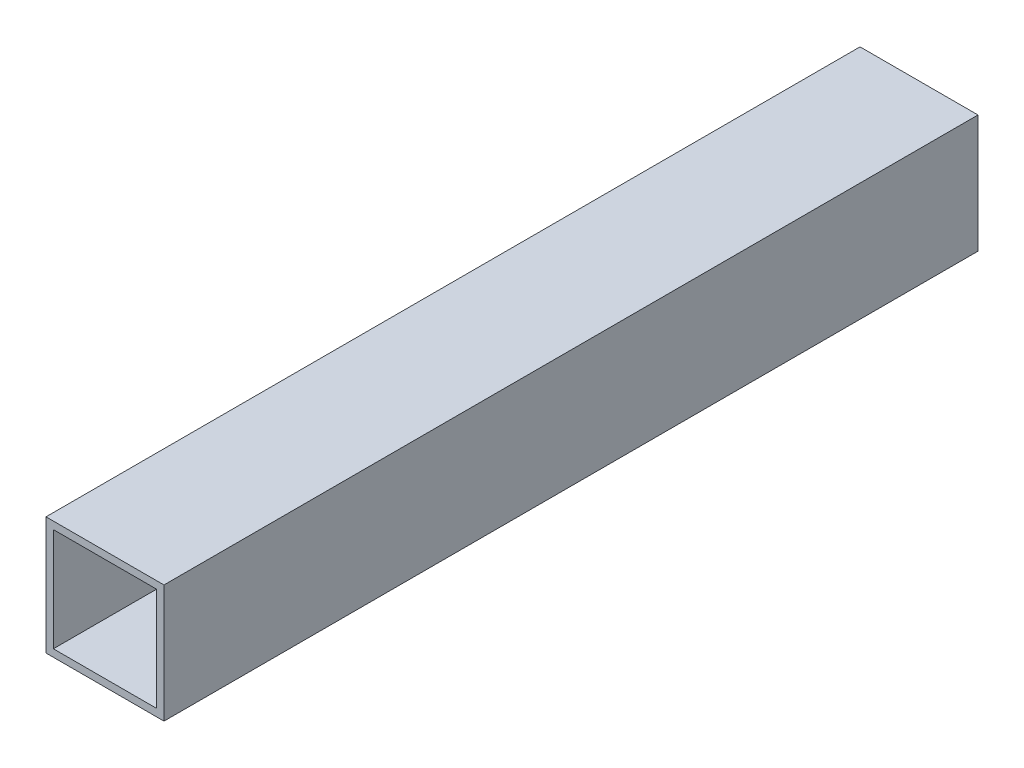
ISO-10303-21;
HEADER;
FILE_DESCRIPTION(('STEP AP214'),'2;1');
FILE_NAME('part.step','',(''),(''),'','','');
FILE_SCHEMA(('AUTOMOTIVE_DESIGN { 1 0 10303 214 1 1 1 1 }'));
ENDSEC;
DATA;
#1=APPLICATION_CONTEXT('core data for automotive mechanical design processes');
#2=APPLICATION_PROTOCOL_DEFINITION('international standard','automotive_design',2000,#1);
#3=PRODUCT_CONTEXT('',#1,'mechanical');
#4=PRODUCT('Part','Part','',(#3));
#5=PRODUCT_RELATED_PRODUCT_CATEGORY('part','',(#4));
#6=PRODUCT_DEFINITION_FORMATION('','',#4);
#7=PRODUCT_DEFINITION_CONTEXT('part definition',#1,'design');
#8=PRODUCT_DEFINITION('design','',#6,#7);
#9=PRODUCT_DEFINITION_SHAPE('','',#8);
#10=(LENGTH_UNIT() NAMED_UNIT(*) SI_UNIT(.MILLI.,.METRE.));
#11=(NAMED_UNIT(*) PLANE_ANGLE_UNIT() SI_UNIT($,.RADIAN.));
#12=(NAMED_UNIT(*) SI_UNIT($,.STERADIAN.) SOLID_ANGLE_UNIT());
#13=UNCERTAINTY_MEASURE_WITH_UNIT(LENGTH_MEASURE(1.E-05),#10,'distance_accuracy_value','');
#14=(GEOMETRIC_REPRESENTATION_CONTEXT(3) GLOBAL_UNCERTAINTY_ASSIGNED_CONTEXT((#13)) GLOBAL_UNIT_ASSIGNED_CONTEXT((#10,
#11,#12)) REPRESENTATION_CONTEXT('',''));
#15=CARTESIAN_POINT('',(0.,0.,0.));
#16=DIRECTION('',(0.,0.,1.));
#17=DIRECTION('',(1.,0.,0.));
#18=AXIS2_PLACEMENT_3D('',#15,#16,#17);
#19=CARTESIAN_POINT('',(12.7,-12.7,87.63));
#20=DIRECTION('',(-1.,0.,0.));
#21=DIRECTION('',(0.,0.,1.));
#22=AXIS2_PLACEMENT_3D('',#19,#20,#21);
#23=PLANE('',#22);
#24=DIRECTION('',(0.,1.,0.));
#25=VECTOR('',#24,1.);
#26=CARTESIAN_POINT('',(12.7,-12.7,-87.63));
#27=LINE('',#26,#25);
#28=CARTESIAN_POINT('',(12.7,-12.7,-87.63));
#29=VERTEX_POINT('',#28);
#30=CARTESIAN_POINT('',(12.7,12.7,-87.63));
#31=VERTEX_POINT('',#30);
#32=EDGE_CURVE('E132',#29,#31,#27,.T.);
#33=ORIENTED_EDGE('',*,*,#32,.T.);
#34=DIRECTION('',(0.,0.,-1.));
#35=VECTOR('',#34,1.);
#36=CARTESIAN_POINT('',(12.7,12.7,87.63));
#37=LINE('',#36,#35);
#38=CARTESIAN_POINT('',(12.7,12.7,87.63));
#39=VERTEX_POINT('',#38);
#40=EDGE_CURVE('E11',#39,#31,#37,.T.);
#41=ORIENTED_EDGE('',*,*,#40,.F.);
#42=DIRECTION('',(0.,1.,0.));
#43=VECTOR('',#42,1.);
#44=CARTESIAN_POINT('',(12.7,-12.7,87.63));
#45=LINE('',#44,#43);
#46=CARTESIAN_POINT('',(12.7,-12.7,87.63));
#47=VERTEX_POINT('',#46);
#48=EDGE_CURVE('E136',#47,#39,#45,.T.);
#49=ORIENTED_EDGE('',*,*,#48,.F.);
#50=DIRECTION('',(0.,0.,-1.));
#51=VECTOR('',#50,1.);
#52=CARTESIAN_POINT('',(12.7,-12.7,87.63));
#53=LINE('',#52,#51);
#54=EDGE_CURVE('E146',#47,#29,#53,.T.);
#55=ORIENTED_EDGE('',*,*,#54,.T.);
#56=EDGE_LOOP('',(#33,#41,#49,#55));
#57=FACE_BOUND('',#56,.T.);
#58=ADVANCED_FACE('F35',(#57),#23,.F.);
#59=CARTESIAN_POINT('',(-12.7,12.7,87.63));
#60=DIRECTION('',(0.,-1.,0.));
#61=DIRECTION('',(0.,0.,-1.));
#62=AXIS2_PLACEMENT_3D('',#59,#60,#61);
#63=PLANE('',#62);
#64=DIRECTION('',(-1.,0.,0.));
#65=VECTOR('',#64,1.);
#66=CARTESIAN_POINT('',(-12.7,12.7,-87.63));
#67=LINE('',#66,#65);
#68=CARTESIAN_POINT('',(-12.7,12.7,-87.63));
#69=VERTEX_POINT('',#68);
#70=EDGE_CURVE('E149',#31,#69,#67,.T.);
#71=ORIENTED_EDGE('',*,*,#70,.T.);
#72=DIRECTION('',(0.,0.,-1.));
#73=VECTOR('',#72,1.);
#74=CARTESIAN_POINT('',(-12.7,12.7,87.63));
#75=LINE('',#74,#73);
#76=CARTESIAN_POINT('',(-12.7,12.7,87.63));
#77=VERTEX_POINT('',#76);
#78=EDGE_CURVE('E42',#77,#69,#75,.T.);
#79=ORIENTED_EDGE('',*,*,#78,.F.);
#80=DIRECTION('',(-1.,0.,0.));
#81=VECTOR('',#80,1.);
#82=CARTESIAN_POINT('',(-12.7,12.7,87.63));
#83=LINE('',#82,#81);
#84=EDGE_CURVE('E139',#39,#77,#83,.T.);
#85=ORIENTED_EDGE('',*,*,#84,.F.);
#86=ORIENTED_EDGE('',*,*,#40,.T.);
#87=EDGE_LOOP('',(#71,#79,#85,#86));
#88=FACE_BOUND('',#87,.T.);
#89=ADVANCED_FACE('F177',(#88),#63,.F.);
#90=CARTESIAN_POINT('',(-12.7,-12.7,87.63));
#91=DIRECTION('',(1.,0.,0.));
#92=DIRECTION('',(0.,0.,-1.));
#93=AXIS2_PLACEMENT_3D('',#90,#91,#92);
#94=PLANE('',#93);
#95=DIRECTION('',(0.,-1.,0.));
#96=VECTOR('',#95,1.);
#97=CARTESIAN_POINT('',(-12.7,-12.7,-87.63));
#98=LINE('',#97,#96);
#99=CARTESIAN_POINT('',(-12.7,-12.7,-87.63));
#100=VERTEX_POINT('',#99);
#101=EDGE_CURVE('E151',#69,#100,#98,.T.);
#102=ORIENTED_EDGE('',*,*,#101,.T.);
#103=DIRECTION('',(0.,0.,-1.));
#104=VECTOR('',#103,1.);
#105=CARTESIAN_POINT('',(-12.7,-12.7,87.63));
#106=LINE('',#105,#104);
#107=CARTESIAN_POINT('',(-12.7,-12.7,87.63));
#108=VERTEX_POINT('',#107);
#109=EDGE_CURVE('E156',#108,#100,#106,.T.);
#110=ORIENTED_EDGE('',*,*,#109,.F.);
#111=DIRECTION('',(0.,-1.,0.));
#112=VECTOR('',#111,1.);
#113=CARTESIAN_POINT('',(-12.7,-12.7,87.63));
#114=LINE('',#113,#112);
#115=EDGE_CURVE('E142',#77,#108,#114,.T.);
#116=ORIENTED_EDGE('',*,*,#115,.F.);
#117=ORIENTED_EDGE('',*,*,#78,.T.);
#118=EDGE_LOOP('',(#102,#110,#116,#117));
#119=FACE_BOUND('',#118,.T.);
#120=ADVANCED_FACE('F163',(#119),#94,.F.);
#121=CARTESIAN_POINT('',(-12.7,-12.7,87.63));
#122=DIRECTION('',(0.,1.,0.));
#123=DIRECTION('',(0.,0.,1.));
#124=AXIS2_PLACEMENT_3D('',#121,#122,#123);
#125=PLANE('',#124);
#126=DIRECTION('',(1.,0.,0.));
#127=VECTOR('',#126,1.);
#128=CARTESIAN_POINT('',(-12.7,-12.7,-87.63));
#129=LINE('',#128,#127);
#130=EDGE_CURVE('E140',#100,#29,#129,.T.);
#131=ORIENTED_EDGE('',*,*,#130,.T.);
#132=ORIENTED_EDGE('',*,*,#54,.F.);
#133=DIRECTION('',(1.,0.,0.));
#134=VECTOR('',#133,1.);
#135=CARTESIAN_POINT('',(-12.7,-12.7,87.63));
#136=LINE('',#135,#134);
#137=EDGE_CURVE('E144',#108,#47,#136,.T.);
#138=ORIENTED_EDGE('',*,*,#137,.F.);
#139=ORIENTED_EDGE('',*,*,#109,.T.);
#140=EDGE_LOOP('',(#131,#132,#138,#139));
#141=FACE_BOUND('',#140,.T.);
#142=ADVANCED_FACE('F170',(#141),#125,.F.);
#143=CARTESIAN_POINT('',(0.,0.,87.63));
#144=DIRECTION('',(0.,0.,-1.));
#145=DIRECTION('',(-1.,0.,0.));
#146=AXIS2_PLACEMENT_3D('',#143,#144,#145);
#147=PLANE('',#146);
#148=DIRECTION('',(-1.,0.,0.));
#149=VECTOR('',#148,1.);
#150=CARTESIAN_POINT('',(-11.1125,11.1125,87.63));
#151=LINE('',#150,#149);
#152=CARTESIAN_POINT('',(11.1125,11.1125,87.63));
#153=VERTEX_POINT('',#152);
#154=CARTESIAN_POINT('',(-11.1125,11.1125,87.63));
#155=VERTEX_POINT('',#154);
#156=EDGE_CURVE('E126',#153,#155,#151,.T.);
#157=ORIENTED_EDGE('',*,*,#156,.F.);
#158=DIRECTION('',(0.,1.,0.));
#159=VECTOR('',#158,1.);
#160=CARTESIAN_POINT('',(11.1125,-11.1125,87.63));
#161=LINE('',#160,#159);
#162=CARTESIAN_POINT('',(11.1125,-11.1125,87.63));
#163=VERTEX_POINT('',#162);
#164=EDGE_CURVE('E49',#163,#153,#161,.T.);
#165=ORIENTED_EDGE('',*,*,#164,.F.);
#166=DIRECTION('',(1.,0.,0.));
#167=VECTOR('',#166,1.);
#168=CARTESIAN_POINT('',(-11.1125,-11.1125,87.63));
#169=LINE('',#168,#167);
#170=CARTESIAN_POINT('',(-11.1125,-11.1125,87.63));
#171=VERTEX_POINT('',#170);
#172=EDGE_CURVE('E117',#171,#163,#169,.T.);
#173=ORIENTED_EDGE('',*,*,#172,.F.);
#174=DIRECTION('',(0.,-1.,0.));
#175=VECTOR('',#174,1.);
#176=CARTESIAN_POINT('',(-11.1125,-11.1125,87.63));
#177=LINE('',#176,#175);
#178=EDGE_CURVE('E120',#155,#171,#177,.T.);
#179=ORIENTED_EDGE('',*,*,#178,.F.);
#180=EDGE_LOOP('',(#157,#165,#173,#179));
#181=FACE_BOUND('',#180,.T.);
#182=ORIENTED_EDGE('',*,*,#48,.T.);
#183=ORIENTED_EDGE('',*,*,#84,.T.);
#184=ORIENTED_EDGE('',*,*,#115,.T.);
#185=ORIENTED_EDGE('',*,*,#137,.T.);
#186=EDGE_LOOP('',(#182,#183,#184,#185));
#187=FACE_BOUND('',#186,.T.);
#188=ADVANCED_FACE('F176',(#181,#187),#147,.F.);
#189=CARTESIAN_POINT('',(0.,0.,-87.63));
#190=DIRECTION('',(0.,0.,-1.));
#191=DIRECTION('',(-1.,0.,0.));
#192=AXIS2_PLACEMENT_3D('',#189,#190,#191);
#193=PLANE('',#192);
#194=DIRECTION('',(0.,1.,0.));
#195=VECTOR('',#194,1.);
#196=CARTESIAN_POINT('',(11.1125,-11.1125,-87.63));
#197=LINE('',#196,#195);
#198=CARTESIAN_POINT('',(11.1125,-11.1125,-87.63));
#199=VERTEX_POINT('',#198);
#200=CARTESIAN_POINT('',(11.1125,11.1125,-87.63));
#201=VERTEX_POINT('',#200);
#202=EDGE_CURVE('E101',#199,#201,#197,.T.);
#203=ORIENTED_EDGE('',*,*,#202,.T.);
#204=DIRECTION('',(-1.,0.,0.));
#205=VECTOR('',#204,1.);
#206=CARTESIAN_POINT('',(-11.1125,11.1125,-87.63));
#207=LINE('',#206,#205);
#208=CARTESIAN_POINT('',(-11.1125,11.1125,-87.63));
#209=VERTEX_POINT('',#208);
#210=EDGE_CURVE('E110',#201,#209,#207,.T.);
#211=ORIENTED_EDGE('',*,*,#210,.T.);
#212=DIRECTION('',(0.,-1.,0.));
#213=VECTOR('',#212,1.);
#214=CARTESIAN_POINT('',(-11.1125,-11.1125,-87.63));
#215=LINE('',#214,#213);
#216=CARTESIAN_POINT('',(-11.1125,-11.1125,-87.63));
#217=VERTEX_POINT('',#216);
#218=EDGE_CURVE('E57',#209,#217,#215,.T.);
#219=ORIENTED_EDGE('',*,*,#218,.T.);
#220=DIRECTION('',(1.,0.,0.));
#221=VECTOR('',#220,1.);
#222=CARTESIAN_POINT('',(-11.1125,-11.1125,-87.63));
#223=LINE('',#222,#221);
#224=EDGE_CURVE('E107',#217,#199,#223,.T.);
#225=ORIENTED_EDGE('',*,*,#224,.T.);
#226=EDGE_LOOP('',(#203,#211,#219,#225));
#227=FACE_BOUND('',#226,.T.);
#228=ORIENTED_EDGE('',*,*,#32,.F.);
#229=ORIENTED_EDGE('',*,*,#130,.F.);
#230=ORIENTED_EDGE('',*,*,#101,.F.);
#231=ORIENTED_EDGE('',*,*,#70,.F.);
#232=EDGE_LOOP('',(#228,#229,#230,#231));
#233=FACE_BOUND('',#232,.T.);
#234=ADVANCED_FACE('F114',(#227,#233),#193,.T.);
#235=CARTESIAN_POINT('',(11.1125,-11.1125,-87.63));
#236=DIRECTION('',(1.,0.,0.));
#237=DIRECTION('',(0.,0.,-1.));
#238=AXIS2_PLACEMENT_3D('',#235,#236,#237);
#239=PLANE('',#238);
#240=ORIENTED_EDGE('',*,*,#164,.T.);
#241=DIRECTION('',(0.,0.,1.));
#242=VECTOR('',#241,1.);
#243=CARTESIAN_POINT('',(11.1125,11.1125,-87.63));
#244=LINE('',#243,#242);
#245=EDGE_CURVE('E97',#201,#153,#244,.T.);
#246=ORIENTED_EDGE('',*,*,#245,.F.);
#247=ORIENTED_EDGE('',*,*,#202,.F.);
#248=DIRECTION('',(0.,0.,1.));
#249=VECTOR('',#248,1.);
#250=CARTESIAN_POINT('',(11.1125,-11.1125,-87.63));
#251=LINE('',#250,#249);
#252=EDGE_CURVE('E130',#199,#163,#251,.T.);
#253=ORIENTED_EDGE('',*,*,#252,.T.);
#254=EDGE_LOOP('',(#240,#246,#247,#253));
#255=FACE_BOUND('',#254,.T.);
#256=ADVANCED_FACE('F99',(#255),#239,.F.);
#257=CARTESIAN_POINT('',(-11.1125,-11.1125,-87.63));
#258=DIRECTION('',(0.,-1.,0.));
#259=DIRECTION('',(0.,0.,-1.));
#260=AXIS2_PLACEMENT_3D('',#257,#258,#259);
#261=PLANE('',#260);
#262=ORIENTED_EDGE('',*,*,#172,.T.);
#263=ORIENTED_EDGE('',*,*,#252,.F.);
#264=ORIENTED_EDGE('',*,*,#224,.F.);
#265=DIRECTION('',(0.,0.,1.));
#266=VECTOR('',#265,1.);
#267=CARTESIAN_POINT('',(-11.1125,-11.1125,-87.63));
#268=LINE('',#267,#266);
#269=EDGE_CURVE('E133',#217,#171,#268,.T.);
#270=ORIENTED_EDGE('',*,*,#269,.T.);
#271=EDGE_LOOP('',(#262,#263,#264,#270));
#272=FACE_BOUND('',#271,.T.);
#273=ADVANCED_FACE('F194',(#272),#261,.F.);
#274=CARTESIAN_POINT('',(-11.1125,-11.1125,-87.63));
#275=DIRECTION('',(-1.,0.,0.));
#276=DIRECTION('',(0.,0.,1.));
#277=AXIS2_PLACEMENT_3D('',#274,#275,#276);
#278=PLANE('',#277);
#279=ORIENTED_EDGE('',*,*,#178,.T.);
#280=ORIENTED_EDGE('',*,*,#269,.F.);
#281=ORIENTED_EDGE('',*,*,#218,.F.);
#282=DIRECTION('',(0.,0.,1.));
#283=VECTOR('',#282,1.);
#284=CARTESIAN_POINT('',(-11.1125,11.1125,-87.63));
#285=LINE('',#284,#283);
#286=EDGE_CURVE('E106',#209,#155,#285,.T.);
#287=ORIENTED_EDGE('',*,*,#286,.T.);
#288=EDGE_LOOP('',(#279,#280,#281,#287));
#289=FACE_BOUND('',#288,.T.);
#290=ADVANCED_FACE('F197',(#289),#278,.F.);
#291=CARTESIAN_POINT('',(-11.1125,11.1125,-87.63));
#292=DIRECTION('',(0.,1.,0.));
#293=DIRECTION('',(0.,0.,1.));
#294=AXIS2_PLACEMENT_3D('',#291,#292,#293);
#295=PLANE('',#294);
#296=ORIENTED_EDGE('',*,*,#156,.T.);
#297=ORIENTED_EDGE('',*,*,#286,.F.);
#298=ORIENTED_EDGE('',*,*,#210,.F.);
#299=ORIENTED_EDGE('',*,*,#245,.T.);
#300=EDGE_LOOP('',(#296,#297,#298,#299));
#301=FACE_BOUND('',#300,.T.);
#302=ADVANCED_FACE('F111',(#301),#295,.F.);
#303=CLOSED_SHELL('',(#58,#89,#120,#142,#188,#234,#256,#273,#290,#302));
#304=MANIFOLD_SOLID_BREP('B2',#303);
#305=ADVANCED_BREP_SHAPE_REPRESENTATION('',(#18,#304),#14);
#306=SHAPE_DEFINITION_REPRESENTATION(#9,#305);
ENDSEC;
END-ISO-10303-21;
